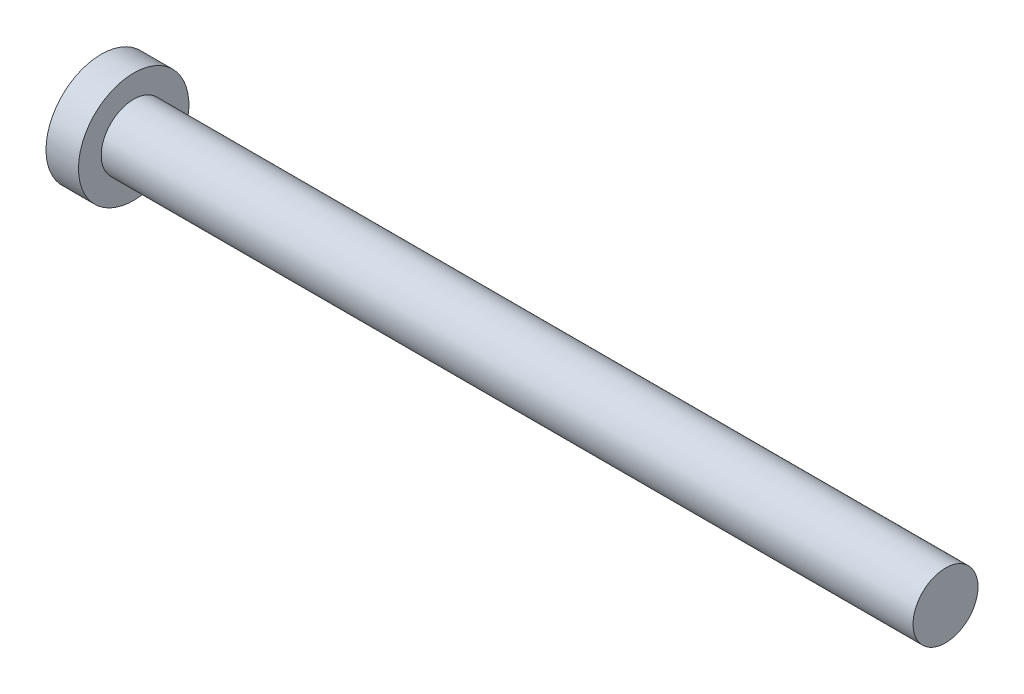
ISO-10303-21;
HEADER;
FILE_DESCRIPTION(('STEP AP214'),'2;1');
FILE_NAME('part.step','',(''),(''),'','','');
FILE_SCHEMA(('AUTOMOTIVE_DESIGN { 1 0 10303 214 1 1 1 1 }'));
ENDSEC;
DATA;
#1=APPLICATION_CONTEXT('core data for automotive mechanical design processes');
#2=APPLICATION_PROTOCOL_DEFINITION('international standard','automotive_design',2000,#1);
#3=PRODUCT_CONTEXT('',#1,'mechanical');
#4=PRODUCT('Part','Part','',(#3));
#5=PRODUCT_RELATED_PRODUCT_CATEGORY('part','',(#4));
#6=PRODUCT_DEFINITION_FORMATION('','',#4);
#7=PRODUCT_DEFINITION_CONTEXT('part definition',#1,'design');
#8=PRODUCT_DEFINITION('design','',#6,#7);
#9=PRODUCT_DEFINITION_SHAPE('','',#8);
#10=(LENGTH_UNIT() NAMED_UNIT(*) SI_UNIT(.MILLI.,.METRE.));
#11=(NAMED_UNIT(*) PLANE_ANGLE_UNIT() SI_UNIT($,.RADIAN.));
#12=(NAMED_UNIT(*) SI_UNIT($,.STERADIAN.) SOLID_ANGLE_UNIT());
#13=UNCERTAINTY_MEASURE_WITH_UNIT(LENGTH_MEASURE(1.E-05),#10,'distance_accuracy_value','');
#14=(GEOMETRIC_REPRESENTATION_CONTEXT(3) GLOBAL_UNCERTAINTY_ASSIGNED_CONTEXT((#13)) GLOBAL_UNIT_ASSIGNED_CONTEXT((#10,
#11,#12)) REPRESENTATION_CONTEXT('',''));
#15=CARTESIAN_POINT('',(0.,0.,0.));
#16=DIRECTION('',(0.,0.,1.));
#17=DIRECTION('',(1.,0.,0.));
#18=AXIS2_PLACEMENT_3D('',#15,#16,#17);
#19=CARTESIAN_POINT('',(1.2,-0.19,-0.19));
#20=DIRECTION('',(-1.,0.,0.));
#21=DIRECTION('',(0.,0.,1.));
#22=AXIS2_PLACEMENT_3D('',#19,#20,#21);
#23=PLANE('',#22);
#24=DIRECTION('',(0.,0.,-1.));
#25=VECTOR('',#24,1.);
#26=CARTESIAN_POINT('',(1.2,0.095,0.843966809971212));
#27=LINE('',#26,#25);
#28=CARTESIAN_POINT('',(1.2,0.095,0.095));
#29=VERTEX_POINT('',#28);
#30=CARTESIAN_POINT('',(1.20000000000001,0.0950000000000003,0.190000000000022));
#31=VERTEX_POINT('',#30);
#32=EDGE_CURVE('E171',#29,#31,#27,.F.);
#33=ORIENTED_EDGE('',*,*,#32,.F.);
#34=DIRECTION('',(0.,1.,0.));
#35=VECTOR('',#34,1.);
#36=CARTESIAN_POINT('',(1.2,0.095,0.095));
#37=LINE('',#36,#35);
#38=CARTESIAN_POINT('',(1.2,0.19,0.095));
#39=VERTEX_POINT('',#38);
#40=EDGE_CURVE('E177',#39,#29,#37,.F.);
#41=ORIENTED_EDGE('',*,*,#40,.F.);
#42=DIRECTION('',(0.,0.,1.));
#43=VECTOR('',#42,1.);
#44=CARTESIAN_POINT('',(1.2,0.19,-0.095));
#45=LINE('',#44,#43);
#46=CARTESIAN_POINT('',(1.2,0.19,-0.0950000000000004));
#47=VERTEX_POINT('',#46);
#48=EDGE_CURVE('E201',#47,#39,#45,.T.);
#49=ORIENTED_EDGE('',*,*,#48,.F.);
#50=DIRECTION('',(0.,1.,0.));
#51=VECTOR('',#50,1.);
#52=CARTESIAN_POINT('',(1.2,0.095,-0.095));
#53=LINE('',#52,#51);
#54=CARTESIAN_POINT('',(1.2,0.0950000000000001,-0.095));
#55=VERTEX_POINT('',#54);
#56=EDGE_CURVE('E196',#55,#47,#53,.T.);
#57=ORIENTED_EDGE('',*,*,#56,.F.);
#58=DIRECTION('',(0.,0.,-1.));
#59=VECTOR('',#58,1.);
#60=CARTESIAN_POINT('',(1.2,0.095,-0.095));
#61=LINE('',#60,#59);
#62=CARTESIAN_POINT('',(1.2,0.095,-0.19));
#63=VERTEX_POINT('',#62);
#64=EDGE_CURVE('E211',#63,#55,#61,.F.);
#65=ORIENTED_EDGE('',*,*,#64,.F.);
#66=DIRECTION('',(0.,1.,0.));
#67=VECTOR('',#66,1.);
#68=CARTESIAN_POINT('',(1.2,-0.095,-0.19));
#69=LINE('',#68,#67);
#70=CARTESIAN_POINT('',(1.2,-0.0950000000000003,-0.19));
#71=VERTEX_POINT('',#70);
#72=EDGE_CURVE('E131',#71,#63,#69,.T.);
#73=ORIENTED_EDGE('',*,*,#72,.F.);
#74=DIRECTION('',(0.,0.,1.));
#75=VECTOR('',#74,1.);
#76=CARTESIAN_POINT('',(1.2,-0.095,-0.095));
#77=LINE('',#76,#75);
#78=CARTESIAN_POINT('',(1.20000000000001,-0.095,-0.095));
#79=VERTEX_POINT('',#78);
#80=EDGE_CURVE('E128',#79,#71,#77,.F.);
#81=ORIENTED_EDGE('',*,*,#80,.F.);
#82=DIRECTION('',(0.,1.,0.));
#83=VECTOR('',#82,1.);
#84=CARTESIAN_POINT('',(1.20000000000001,-0.843966809971212,-0.095));
#85=LINE('',#84,#83);
#86=CARTESIAN_POINT('',(1.20000000000002,-0.190000000000025,-0.095));
#87=VERTEX_POINT('',#86);
#88=EDGE_CURVE('E195',#87,#79,#85,.T.);
#89=ORIENTED_EDGE('',*,*,#88,.F.);
#90=DIRECTION('',(0.,0.,1.));
#91=VECTOR('',#90,1.);
#92=CARTESIAN_POINT('',(1.20000000000002,-0.190000000000025,-0.095));
#93=LINE('',#92,#91);
#94=CARTESIAN_POINT('',(1.20000000000001,-0.190000000000022,0.0950000000000004));
#95=VERTEX_POINT('',#94);
#96=EDGE_CURVE('E184',#95,#87,#93,.F.);
#97=ORIENTED_EDGE('',*,*,#96,.F.);
#98=DIRECTION('',(0.,1.,0.));
#99=VECTOR('',#98,1.);
#100=CARTESIAN_POINT('',(1.2,-0.843966809971212,0.095));
#101=LINE('',#100,#99);
#102=CARTESIAN_POINT('',(1.2,-0.0950000000000001,0.095));
#103=VERTEX_POINT('',#102);
#104=EDGE_CURVE('E190',#103,#95,#101,.F.);
#105=ORIENTED_EDGE('',*,*,#104,.F.);
#106=DIRECTION('',(0.,0.,1.));
#107=VECTOR('',#106,1.);
#108=CARTESIAN_POINT('',(1.20000000000001,-0.095,0.843966809971212));
#109=LINE('',#108,#107);
#110=CARTESIAN_POINT('',(1.20000000000002,-0.095,0.190000000000025));
#111=VERTEX_POINT('',#110);
#112=EDGE_CURVE('E219',#111,#103,#109,.F.);
#113=ORIENTED_EDGE('',*,*,#112,.F.);
#114=DIRECTION('',(0.,1.,0.));
#115=VECTOR('',#114,1.);
#116=CARTESIAN_POINT('',(1.20000000000002,-0.095,0.190000000000025));
#117=LINE('',#116,#115);
#118=EDGE_CURVE('E147',#31,#111,#117,.F.);
#119=ORIENTED_EDGE('',*,*,#118,.F.);
#120=EDGE_LOOP('',(#33,#41,#49,#57,#65,#73,#81,#89,#97,#105,#113,#119));
#121=FACE_BOUND('',#120,.T.);
#122=ADVANCED_FACE('F17',(#121),#23,.T.);
#123=CARTESIAN_POINT('',(0.02019022267104,-0.095,-0.095));
#124=DIRECTION('',(0.,1.,0.));
#125=DIRECTION('',(0.,0.,1.));
#126=AXIS2_PLACEMENT_3D('',#123,#124,#125);
#127=PLANE('',#126);
#128=DIRECTION('',(0.844819075554241,0.,0.535052081184326));
#129=VECTOR('',#128,1.);
#130=CARTESIAN_POINT('',(1.2,-0.0950000000000005,-0.19));
#131=LINE('',#130,#129);
#132=CARTESIAN_POINT('',(0.179129531050745,-0.0950000000000008,-0.836551297001163));
#133=VERTEX_POINT('',#132);
#134=EDGE_CURVE('E125',#133,#71,#131,.T.);
#135=ORIENTED_EDGE('',*,*,#134,.F.);
#136=CARTESIAN_POINT('',(0.0201902226710378,-0.0949999999999999,-0.0950000000000002));
#137=CARTESIAN_POINT('',(0.0226398425543797,-0.095,-0.115973537349649));
#138=CARTESIAN_POINT('',(0.0254310616733796,-0.095,-0.136901889729609));
#139=CARTESIAN_POINT('',(0.031513977938195,-0.095,-0.178683060358681));
#140=CARTESIAN_POINT('',(0.0348055950614788,-0.095,-0.199535890140267));
#141=CARTESIAN_POINT('',(0.0417027666883325,-0.095,-0.241159060685075));
#142=CARTESIAN_POINT('',(0.0453078857145207,-0.095,-0.261929475257049));
#143=CARTESIAN_POINT('',(0.0527977658908118,-0.095,-0.303420906414412));
#144=CARTESIAN_POINT('',(0.0566825410806537,-0.095,-0.32414192046569));
#145=CARTESIAN_POINT('',(0.0687079641287518,-0.095,-0.386210617550224));
#146=CARTESIAN_POINT('',(0.0772234385665859,-0.095,-0.427486049649871));
#147=CARTESIAN_POINT('',(0.0951732951897512,-0.095,-0.509828657388712));
#148=CARTESIAN_POINT('',(0.104607525851427,-0.095,-0.55089586619724));
#149=CARTESIAN_POINT('',(0.124372929898086,-0.095,-0.632841771316391));
#150=CARTESIAN_POINT('',(0.134704675408607,-0.095,-0.673720329627371));
#151=CARTESIAN_POINT('',(0.156256369772992,-0.095,-0.755291264272398));
#152=CARTESIAN_POINT('',(0.167477292619544,-0.095,-0.795983383316545));
#153=CARTESIAN_POINT('',(0.179129531050741,-0.095,-0.836551297001183));
#154=B_SPLINE_CURVE_WITH_KNOTS('',3,(#136,#137,#138,#139,#140,#141,#142,#143,#144,#145,#146,
#147,#148,#149,#150,#151,#152,#153),.UNSPECIFIED.,.F.,.F.,(4,2,2,2,2,2,2,2,4),(0.,
0.063338021498771,0.126665924756856,0.189907224655068,0.253151701709765,0.379573454882021,
0.505974393447311,0.632456506666061,0.759079134417615),.UNSPECIFIED.);
#155=CARTESIAN_POINT('',(0.0201902226710386,-0.095,-0.0950000000000001));
#156=VERTEX_POINT('',#155);
#157=EDGE_CURVE('E21',#156,#133,#154,.T.);
#158=ORIENTED_EDGE('',*,*,#157,.F.);
#159=DIRECTION('',(1.,0.,0.));
#160=VECTOR('',#159,1.);
#161=CARTESIAN_POINT('',(0.02019022267104,-0.095,-0.095));
#162=LINE('',#161,#160);
#163=EDGE_CURVE('E193',#79,#156,#162,.F.);
#164=ORIENTED_EDGE('',*,*,#163,.F.);
#165=ORIENTED_EDGE('',*,*,#80,.T.);
#166=EDGE_LOOP('',(#135,#158,#164,#165));
#167=FACE_BOUND('',#166,.T.);
#168=ADVANCED_FACE('F127',(#167),#127,.T.);
#169=CARTESIAN_POINT('',(1.2,-0.095,-0.19));
#170=DIRECTION('',(-0.535052081184326,0.,0.844819075554241));
#171=DIRECTION('',(0.844819075554241,0.,0.535052081184326));
#172=AXIS2_PLACEMENT_3D('',#169,#170,#171);
#173=PLANE('',#172);
#174=CARTESIAN_POINT('',(0.179129531050737,-0.0950000000000011,-0.836551297001168));
#175=CARTESIAN_POINT('',(0.178254696167839,-0.0633333333333341,-0.83710535909367));
#176=CARTESIAN_POINT('',(0.177817278726389,-0.031666666666667,-0.837382390139921));
#177=CARTESIAN_POINT('',(0.177817278726389,0.031666666666667,-0.837382390139921));
#178=CARTESIAN_POINT('',(0.178254696167839,0.0633333333333341,-0.83710535909367));
#179=CARTESIAN_POINT('',(0.179129531050737,0.0950000000000011,-0.836551297001168));
#180=B_SPLINE_CURVE_WITH_KNOTS('',3,(#174,#175,#176,#177,#178,#179),.UNSPECIFIED.,.F.,.F.,(4,2,
4),(0.,0.0950126976880893,0.190025395376179),.UNSPECIFIED.);
#181=CARTESIAN_POINT('',(0.179129531050757,0.095,-0.836551297001189));
#182=VERTEX_POINT('',#181);
#183=EDGE_CURVE('E134',#133,#182,#180,.T.);
#184=ORIENTED_EDGE('',*,*,#183,.F.);
#185=ORIENTED_EDGE('',*,*,#134,.T.);
#186=ORIENTED_EDGE('',*,*,#72,.T.);
#187=DIRECTION('',(0.844819075554225,0.,0.535052081184351));
#188=VECTOR('',#187,1.);
#189=CARTESIAN_POINT('',(0.179129531050772,0.095,-0.836551297001188));
#190=LINE('',#189,#188);
#191=EDGE_CURVE('E130',#182,#63,#190,.T.);
#192=ORIENTED_EDGE('',*,*,#191,.F.);
#193=EDGE_LOOP('',(#184,#185,#186,#192));
#194=FACE_BOUND('',#193,.T.);
#195=ADVANCED_FACE('F135',(#194),#173,.T.);
#196=CARTESIAN_POINT('',(0.02019022267104,0.095,-0.095));
#197=DIRECTION('',(0.,-1.,0.));
#198=DIRECTION('',(0.,0.,-1.));
#199=AXIS2_PLACEMENT_3D('',#196,#197,#198);
#200=PLANE('',#199);
#201=ORIENTED_EDGE('',*,*,#64,.T.);
#202=DIRECTION('',(1.,0.,0.));
#203=VECTOR('',#202,1.);
#204=CARTESIAN_POINT('',(0.02019022267104,0.0950000000000001,-0.095));
#205=LINE('',#204,#203);
#206=CARTESIAN_POINT('',(0.0201902226710386,0.0950000000000002,-0.095));
#207=VERTEX_POINT('',#206);
#208=EDGE_CURVE('E208',#207,#55,#205,.T.);
#209=ORIENTED_EDGE('',*,*,#208,.F.);
#210=CARTESIAN_POINT('',(0.179129531050743,0.0950000000000001,-0.836551297001189));
#211=CARTESIAN_POINT('',(0.167477292619542,0.0950000000000002,-0.795983383316541));
#212=CARTESIAN_POINT('',(0.156256369772988,0.0950000000000001,-0.755291264272383));
#213=CARTESIAN_POINT('',(0.134704675408598,0.0949999999999999,-0.673720329627334));
#214=CARTESIAN_POINT('',(0.124372929898074,0.0949999999999998,-0.632841771316343));
#215=CARTESIAN_POINT('',(0.10460752585141,0.0950000000000002,-0.55089586619717));
#216=CARTESIAN_POINT('',(0.0951732951897327,0.0950000000000006,-0.50982865738863));
#217=CARTESIAN_POINT('',(0.0772234385665639,0.0949999999999994,-0.427486049649767));
#218=CARTESIAN_POINT('',(0.0687079641287281,0.0949999999999977,-0.386210617550109));
#219=CARTESIAN_POINT('',(0.0566825410806288,0.0950000000000012,-0.324141920465558));
#220=CARTESIAN_POINT('',(0.0527977658907866,0.0950000000000034,-0.303420906414275));
#221=CARTESIAN_POINT('',(0.0453078857144941,0.0949999999999966,-0.261929475256901));
#222=CARTESIAN_POINT('',(0.0417027666883046,0.0949999999999877,-0.24115906068492));
#223=CARTESIAN_POINT('',(0.0348055950614536,0.0950000000000123,-0.199535890140101));
#224=CARTESIAN_POINT('',(0.0315139779381737,0.0950000000000458,-0.178683060358509));
#225=CARTESIAN_POINT('',(0.0254310616733492,0.0949999999999542,-0.136901889729428));
#226=CARTESIAN_POINT('',(0.0226398425543363,0.0949999999998289,-0.115973537349464));
#227=CARTESIAN_POINT('',(0.020190222670962,0.0949999999995235,-0.0949999999998141));
#228=B_SPLINE_CURVE_WITH_KNOTS('',3,(#210,#211,#212,#213,#214,#215,#216,#217,#218,#219,#220,
#221,#222,#223,#224,#225,#226,#227),.UNSPECIFIED.,.F.,.F.,(4,2,2,2,2,2,2,2,4),(0.,
0.126622627751588,0.253104740970372,0.379505679535696,0.505927432707986,0.5691719097627,
0.632413209660928,0.69574111291903,0.759079134417816),.UNSPECIFIED.);
#229=EDGE_CURVE('E139',#182,#207,#228,.T.);
#230=ORIENTED_EDGE('',*,*,#229,.F.);
#231=ORIENTED_EDGE('',*,*,#191,.T.);
#232=EDGE_LOOP('',(#201,#209,#230,#231));
#233=FACE_BOUND('',#232,.T.);
#234=ADVANCED_FACE('F368',(#233),#200,.T.);
#235=CARTESIAN_POINT('',(0.02019022267104,0.095,-0.095));
#236=DIRECTION('',(0.,0.,1.));
#237=DIRECTION('',(1.,0.,0.));
#238=AXIS2_PLACEMENT_3D('',#235,#236,#237);
#239=PLANE('',#238);
#240=DIRECTION('',(0.844819075554241,-0.535052081184326,0.));
#241=VECTOR('',#240,1.);
#242=CARTESIAN_POINT('',(1.2,0.19,-0.0950000000000006));
#243=LINE('',#242,#241);
#244=CARTESIAN_POINT('',(0.179129531050743,0.836551297001164,-0.0950000000000009));
#245=VERTEX_POINT('',#244);
#246=EDGE_CURVE('E178',#245,#47,#243,.T.);
#247=ORIENTED_EDGE('',*,*,#246,.F.);
#248=CARTESIAN_POINT('',(0.0201902226710378,0.0950000000000003,-0.095));
#249=CARTESIAN_POINT('',(0.0226398425543811,0.115973537349649,-0.095));
#250=CARTESIAN_POINT('',(0.0254310616733818,0.136901889729609,-0.095));
#251=CARTESIAN_POINT('',(0.0315139779381978,0.17868306035868,-0.095));
#252=CARTESIAN_POINT('',(0.0348055950614816,0.199535890140267,-0.095));
#253=CARTESIAN_POINT('',(0.041702766688335,0.241159060685075,-0.095));
#254=CARTESIAN_POINT('',(0.0453078857145231,0.261929475257049,-0.095));
#255=CARTESIAN_POINT('',(0.0527977658908136,0.303420906414412,-0.095));
#256=CARTESIAN_POINT('',(0.0566825410806552,0.324141920465691,-0.095));
#257=CARTESIAN_POINT('',(0.0687079641287525,0.386210617550225,-0.095));
#258=CARTESIAN_POINT('',(0.0772234385665861,0.427486049649872,-0.095));
#259=CARTESIAN_POINT('',(0.0951732951897505,0.509828657388713,-0.095));
#260=CARTESIAN_POINT('',(0.104607525851426,0.550895866197241,-0.095));
#261=CARTESIAN_POINT('',(0.124372929898084,0.632841771316393,-0.095));
#262=CARTESIAN_POINT('',(0.134704675408605,0.673720329627373,-0.095));
#263=CARTESIAN_POINT('',(0.15625636977299,0.755291264272401,-0.095));
#264=CARTESIAN_POINT('',(0.167477292619541,0.795983383316548,-0.095));
#265=CARTESIAN_POINT('',(0.179129531050737,0.836551297001186,-0.095));
#266=B_SPLINE_CURVE_WITH_KNOTS('',3,(#248,#249,#250,#251,#252,#253,#254,#255,#256,#257,#258,
#259,#260,#261,#262,#263,#264,#265),.UNSPECIFIED.,.F.,.F.,(4,2,2,2,2,2,2,2,4),(0.,
0.063338021498771,0.126665924756856,0.189907224655068,0.253151701709765,0.379573454882021,
0.505974393447312,0.632456506666063,0.759079134417617),.UNSPECIFIED.);
#267=EDGE_CURVE('E353',#207,#245,#266,.T.);
#268=ORIENTED_EDGE('',*,*,#267,.F.);
#269=ORIENTED_EDGE('',*,*,#208,.T.);
#270=ORIENTED_EDGE('',*,*,#56,.T.);
#271=EDGE_LOOP('',(#247,#268,#269,#270));
#272=FACE_BOUND('',#271,.T.);
#273=ADVANCED_FACE('F364',(#272),#239,.T.);
#274=CARTESIAN_POINT('',(0.02019022267104,-0.843966809971212,-0.095));
#275=DIRECTION('',(0.,0.,1.));
#276=DIRECTION('',(1.,0.,0.));
#277=AXIS2_PLACEMENT_3D('',#274,#275,#276);
#278=PLANE('',#277);
#279=DIRECTION('',(-0.844819075554241,-0.535052081184326,0.));
#280=VECTOR('',#279,1.);
#281=CARTESIAN_POINT('',(0.167595451513688,-0.843856214041336,-0.095));
#282=LINE('',#281,#280);
#283=CARTESIAN_POINT('',(0.179129531050756,-0.836551297001194,-0.095));
#284=VERTEX_POINT('',#283);
#285=EDGE_CURVE('E199',#87,#284,#282,.T.);
#286=ORIENTED_EDGE('',*,*,#285,.F.);
#287=ORIENTED_EDGE('',*,*,#88,.T.);
#288=ORIENTED_EDGE('',*,*,#163,.T.);
#289=CARTESIAN_POINT('',(0.179129531050743,-0.836551297001203,-0.095));
#290=CARTESIAN_POINT('',(0.167477292619545,-0.795983383316564,-0.095));
#291=CARTESIAN_POINT('',(0.156256369772994,-0.755291264272416,-0.095));
#292=CARTESIAN_POINT('',(0.134704675408609,-0.673720329627386,-0.095));
#293=CARTESIAN_POINT('',(0.124372929898087,-0.632841771316406,-0.095));
#294=CARTESIAN_POINT('',(0.104607525851428,-0.550895866197252,-0.095));
#295=CARTESIAN_POINT('',(0.0951732951897528,-0.509828657388723,-0.095));
#296=CARTESIAN_POINT('',(0.0772234385665878,-0.42748604964988,-0.095));
#297=CARTESIAN_POINT('',(0.0687079641287539,-0.386210617550232,-0.095));
#298=CARTESIAN_POINT('',(0.0566825410806563,-0.324141920465696,-0.095));
#299=CARTESIAN_POINT('',(0.0527977658908146,-0.303420906414417,-0.095));
#300=CARTESIAN_POINT('',(0.0453078857145238,-0.261929475257053,-0.095));
#301=CARTESIAN_POINT('',(0.0417027666883357,-0.241159060685078,-0.095));
#302=CARTESIAN_POINT('',(0.0348055950614821,-0.19953589014027,-0.095));
#303=CARTESIAN_POINT('',(0.0315139779381982,-0.178683060358682,-0.095));
#304=CARTESIAN_POINT('',(0.0254310616733819,-0.13690188972961,-0.095));
#305=CARTESIAN_POINT('',(0.0226398425543812,-0.115973537349649,-0.095));
#306=CARTESIAN_POINT('',(0.0201902226710378,-0.0950000000000003,-0.0950000000000001));
#307=B_SPLINE_CURVE_WITH_KNOTS('',3,(#289,#290,#291,#292,#293,#294,#295,#296,#297,#298,#299,
#300,#301,#302,#303,#304,#305,#306),.UNSPECIFIED.,.F.,.F.,(4,2,2,2,2,2,2,2,4),(0.,
0.126622627751557,0.253104740970311,0.379505679535605,0.505927432707864,0.569171909762563,
0.632413209660776,0.695741112918863,0.759079134417635),.UNSPECIFIED.);
#308=EDGE_CURVE('E144',#284,#156,#307,.T.);
#309=ORIENTED_EDGE('',*,*,#308,.F.);
#310=EDGE_LOOP('',(#286,#287,#288,#309));
#311=FACE_BOUND('',#310,.T.);
#312=ADVANCED_FACE('F367',(#311),#278,.T.);
#313=CARTESIAN_POINT('',(0.02019022267104,-0.095,0.843966809971212));
#314=DIRECTION('',(0.,1.,0.));
#315=DIRECTION('',(0.,0.,1.));
#316=AXIS2_PLACEMENT_3D('',#313,#314,#315);
#317=PLANE('',#316);
#318=DIRECTION('',(-0.844819075554241,0.,0.535052081184326));
#319=VECTOR('',#318,1.);
#320=CARTESIAN_POINT('',(0.167595451519902,-0.095,0.843856214037401));
#321=LINE('',#320,#319);
#322=CARTESIAN_POINT('',(0.179129531050758,-0.0950000000000004,0.836551297001192));
#323=VERTEX_POINT('',#322);
#324=EDGE_CURVE('E145',#111,#323,#321,.T.);
#325=ORIENTED_EDGE('',*,*,#324,.F.);
#326=ORIENTED_EDGE('',*,*,#112,.T.);
#327=DIRECTION('',(-1.,0.,0.));
#328=VECTOR('',#327,1.);
#329=CARTESIAN_POINT('',(0.02019022267104,-0.0950000000000001,0.095));
#330=LINE('',#329,#328);
#331=CARTESIAN_POINT('',(0.0201902226710386,-0.0950000000000002,0.095));
#332=VERTEX_POINT('',#331);
#333=EDGE_CURVE('E185',#332,#103,#330,.F.);
#334=ORIENTED_EDGE('',*,*,#333,.F.);
#335=CARTESIAN_POINT('',(0.179129531050746,-0.0950000000000001,0.8365512970012));
#336=CARTESIAN_POINT('',(0.167477292619545,-0.0950000000000002,0.795983383316551));
#337=CARTESIAN_POINT('',(0.156256369772991,-0.0950000000000001,0.755291264272393));
#338=CARTESIAN_POINT('',(0.1347046754086,-0.0949999999999999,0.673720329627342));
#339=CARTESIAN_POINT('',(0.124372929898076,-0.0949999999999998,0.632841771316351));
#340=CARTESIAN_POINT('',(0.104607525851412,-0.0950000000000002,0.550895866197176));
#341=CARTESIAN_POINT('',(0.0951732951897342,-0.0950000000000006,0.509828657388636));
#342=CARTESIAN_POINT('',(0.0772234385665649,-0.0949999999999994,0.427486049649772));
#343=CARTESIAN_POINT('',(0.068707964128729,-0.0949999999999977,0.386210617550114));
#344=CARTESIAN_POINT('',(0.0566825410806295,-0.0950000000000012,0.324141920465562));
#345=CARTESIAN_POINT('',(0.0527977658907872,-0.0950000000000034,0.303420906414278));
#346=CARTESIAN_POINT('',(0.0453078857144946,-0.0949999999999966,0.261929475256903));
#347=CARTESIAN_POINT('',(0.041702766688305,-0.0949999999999877,0.241159060684923));
#348=CARTESIAN_POINT('',(0.0348055950614539,-0.0950000000000123,0.199535890140103));
#349=CARTESIAN_POINT('',(0.0315139779381739,-0.0950000000000459,0.17868306035851));
#350=CARTESIAN_POINT('',(0.0254310616733493,-0.0949999999999541,0.136901889729428));
#351=CARTESIAN_POINT('',(0.0226398425543364,-0.0949999999998288,0.115973537349464));
#352=CARTESIAN_POINT('',(0.0201902226709619,-0.0949999999995234,0.094999999999814));
#353=B_SPLINE_CURVE_WITH_KNOTS('',3,(#335,#336,#337,#338,#339,#340,#341,#342,#343,#344,#345,
#346,#347,#348,#349,#350,#351,#352),.UNSPECIFIED.,.F.,.F.,(4,2,2,2,2,2,2,2,4),(0.,
0.12662262775159,0.253104740970376,0.379505679535702,0.505927432707994,0.569171909762708,
0.632413209660938,0.69574111291904,0.759079134417828),.UNSPECIFIED.);
#354=EDGE_CURVE('E566',#323,#332,#353,.T.);
#355=ORIENTED_EDGE('',*,*,#354,.F.);
#356=EDGE_LOOP('',(#325,#326,#334,#355));
#357=FACE_BOUND('',#356,.T.);
#358=ADVANCED_FACE('F479',(#357),#317,.T.);
#359=CARTESIAN_POINT('',(0.02019022267104,-0.843966809971212,0.095));
#360=DIRECTION('',(0.,0.,-1.));
#361=DIRECTION('',(-1.,0.,0.));
#362=AXIS2_PLACEMENT_3D('',#359,#360,#361);
#363=PLANE('',#362);
#364=CARTESIAN_POINT('',(0.0201902226710378,-0.0950000000000003,0.0950000000000001));
#365=CARTESIAN_POINT('',(0.0226398425543812,-0.115973537349649,0.095));
#366=CARTESIAN_POINT('',(0.025431061673382,-0.13690188972961,0.095));
#367=CARTESIAN_POINT('',(0.0315139779381982,-0.178683060358682,0.095));
#368=CARTESIAN_POINT('',(0.0348055950614821,-0.19953589014027,0.095));
#369=CARTESIAN_POINT('',(0.0417027666883357,-0.241159060685078,0.095));
#370=CARTESIAN_POINT('',(0.0453078857145239,-0.261929475257053,0.095));
#371=CARTESIAN_POINT('',(0.0527977658908147,-0.303420906414417,0.095));
#372=CARTESIAN_POINT('',(0.0566825410806564,-0.324141920465696,0.095));
#373=CARTESIAN_POINT('',(0.0687079641287541,-0.386210617550232,0.095));
#374=CARTESIAN_POINT('',(0.0772234385665879,-0.42748604964988,0.095));
#375=CARTESIAN_POINT('',(0.095173295189753,-0.509828657388723,0.095));
#376=CARTESIAN_POINT('',(0.104607525851429,-0.550895866197252,0.095));
#377=CARTESIAN_POINT('',(0.124372929898088,-0.632841771316406,0.095));
#378=CARTESIAN_POINT('',(0.134704675408609,-0.673720329627387,0.095));
#379=CARTESIAN_POINT('',(0.156256369772994,-0.755291264272416,0.095));
#380=CARTESIAN_POINT('',(0.167477292619546,-0.795983383316564,0.095));
#381=CARTESIAN_POINT('',(0.179129531050743,-0.836551297001203,0.095));
#382=B_SPLINE_CURVE_WITH_KNOTS('',3,(#364,#365,#366,#367,#368,#369,#370,#371,#372,#373,#374,
#375,#376,#377,#378,#379,#380,#381),.UNSPECIFIED.,.F.,.F.,(4,2,2,2,2,2,2,2,4),(0.,
0.0633380214987725,0.126665924756859,0.189907224655072,0.253151701709771,0.379573454882031,
0.505974393447324,0.632456506666078,0.759079134417635),.UNSPECIFIED.);
#383=CARTESIAN_POINT('',(0.179129531050756,-0.836551297001193,0.095000000000001));
#384=VERTEX_POINT('',#383);
#385=EDGE_CURVE('E323',#332,#384,#382,.T.);
#386=ORIENTED_EDGE('',*,*,#385,.F.);
#387=ORIENTED_EDGE('',*,*,#333,.T.);
#388=ORIENTED_EDGE('',*,*,#104,.T.);
#389=DIRECTION('',(-0.844819075554241,-0.535052081184326,0.));
#390=VECTOR('',#389,1.);
#391=CARTESIAN_POINT('',(0.167595451513688,-0.843856214041336,0.0950000000000006));
#392=LINE('',#391,#390);
#393=EDGE_CURVE('E181',#384,#95,#392,.F.);
#394=ORIENTED_EDGE('',*,*,#393,.F.);
#395=EDGE_LOOP('',(#386,#387,#388,#394));
#396=FACE_BOUND('',#395,.T.);
#397=ADVANCED_FACE('F332',(#396),#363,.T.);
#398=CARTESIAN_POINT('',(0.167595451513688,-0.843856214041336,-0.095));
#399=DIRECTION('',(-0.535052081184326,0.844819075554241,0.));
#400=DIRECTION('',(-0.844819075554241,-0.535052081184326,0.));
#401=AXIS2_PLACEMENT_3D('',#398,#399,#400);
#402=PLANE('',#401);
#403=ORIENTED_EDGE('',*,*,#96,.T.);
#404=ORIENTED_EDGE('',*,*,#285,.T.);
#405=CARTESIAN_POINT('',(0.177817278726398,-0.837382390139953,0.));
#406=CARTESIAN_POINT('',(0.177817494529176,-0.837382253464861,-0.0158375620022803));
#407=CARTESIAN_POINT('',(0.177926956790926,-0.837312927365752,-0.031673009670092));
#408=CARTESIAN_POINT('',(0.178364374232375,-0.837035896319502,-0.0633396763367619));
#409=CARTESIAN_POINT('',(0.178692329412072,-0.83682819137236,-0.0791708953356201));
#410=CARTESIAN_POINT('',(0.179129531050742,-0.836551297001202,-0.0950000000000016));
#411=B_SPLINE_CURVE_WITH_KNOTS('',3,(#405,#406,#407,#408,#409,#410),.UNSPECIFIED.,.F.,.F.,(4,2,
4),(0.,0.0475079332155473,0.0950158664310947),.UNSPECIFIED.);
#412=CARTESIAN_POINT('',(0.177817278726393,-0.837382390139936,0.));
#413=VERTEX_POINT('',#412);
#414=EDGE_CURVE('E338',#413,#284,#411,.T.);
#415=ORIENTED_EDGE('',*,*,#414,.F.);
#416=CARTESIAN_POINT('',(0.179129531050743,-0.836551297001202,0.0950000000000015));
#417=CARTESIAN_POINT('',(0.178692329412072,-0.83682819137236,0.0791708953356227));
#418=CARTESIAN_POINT('',(0.178364374232375,-0.837035896319502,0.0633396763367672));
#419=CARTESIAN_POINT('',(0.177926956790926,-0.837312927365752,0.0316730096701027));
#420=CARTESIAN_POINT('',(0.177817494529176,-0.837382253464861,0.0158375620022938));
#421=CARTESIAN_POINT('',(0.177817278726398,-0.837382390139953,0.));
#422=B_SPLINE_CURVE_WITH_KNOTS('',3,(#416,#417,#418,#419,#420,#421),.UNSPECIFIED.,.F.,.F.,(4,2,
4),(0.,0.0475079332155392,0.0950158664310784),.UNSPECIFIED.);
#423=EDGE_CURVE('E316',#384,#413,#422,.T.);
#424=ORIENTED_EDGE('',*,*,#423,.F.);
#425=ORIENTED_EDGE('',*,*,#393,.T.);
#426=EDGE_LOOP('',(#403,#404,#415,#424,#425));
#427=FACE_BOUND('',#426,.T.);
#428=ADVANCED_FACE('F329',(#427),#402,.T.);
#429=CARTESIAN_POINT('',(1.2,0.19,-0.095));
#430=DIRECTION('',(-0.535052081184326,-0.844819075554241,0.));
#431=DIRECTION('',(0.844819075554241,-0.535052081184326,0.));
#432=AXIS2_PLACEMENT_3D('',#429,#430,#431);
#433=PLANE('',#432);
#434=CARTESIAN_POINT('',(0.179129531050733,0.83655129700117,-0.0950000000000012));
#435=CARTESIAN_POINT('',(0.178692329412063,0.836828191372328,-0.0791708953356211));
#436=CARTESIAN_POINT('',(0.178364374232365,0.83703589631947,-0.0633396763367643));
#437=CARTESIAN_POINT('',(0.177926956790917,0.83731292736572,-0.0316730096700972));
#438=CARTESIAN_POINT('',(0.177817494529166,0.837382253464829,-0.015837562002287));
#439=CARTESIAN_POINT('',(0.177817278726389,0.837382390139921,0.));
#440=B_SPLINE_CURVE_WITH_KNOTS('',3,(#434,#435,#436,#437,#438,#439),.UNSPECIFIED.,.F.,.F.,(4,2,
4),(0.,0.0475079332155431,0.0950158664310862),.UNSPECIFIED.);
#441=CARTESIAN_POINT('',(0.177817278726389,0.837382390139921,0.));
#442=VERTEX_POINT('',#441);
#443=EDGE_CURVE('E344',#245,#442,#440,.T.);
#444=ORIENTED_EDGE('',*,*,#443,.F.);
#445=ORIENTED_EDGE('',*,*,#246,.T.);
#446=ORIENTED_EDGE('',*,*,#48,.T.);
#447=DIRECTION('',(0.844819075554225,-0.53505208118435,0.));
#448=VECTOR('',#447,1.);
#449=CARTESIAN_POINT('',(0.179129531050771,0.836551297001188,0.095));
#450=LINE('',#449,#448);
#451=CARTESIAN_POINT('',(0.179129531050755,0.83655129700119,0.0949999999999999));
#452=VERTEX_POINT('',#451);
#453=EDGE_CURVE('E174',#452,#39,#450,.T.);
#454=ORIENTED_EDGE('',*,*,#453,.F.);
#455=CARTESIAN_POINT('',(0.177817278726389,0.837382390139921,0.));
#456=CARTESIAN_POINT('',(0.177817494529166,0.837382253464829,0.015837562002287));
#457=CARTESIAN_POINT('',(0.177926956790917,0.83731292736572,0.0316730096700972));
#458=CARTESIAN_POINT('',(0.178364374232365,0.83703589631947,0.0633396763367643));
#459=CARTESIAN_POINT('',(0.178692329412063,0.836828191372328,0.0791708953356211));
#460=CARTESIAN_POINT('',(0.179129531050733,0.83655129700117,0.0950000000000012));
#461=B_SPLINE_CURVE_WITH_KNOTS('',3,(#455,#456,#457,#458,#459,#460),.UNSPECIFIED.,.F.,.F.,(4,2,
4),(0.,0.0475079332155431,0.0950158664310862),.UNSPECIFIED.);
#462=EDGE_CURVE('E309',#442,#452,#461,.T.);
#463=ORIENTED_EDGE('',*,*,#462,.F.);
#464=EDGE_LOOP('',(#444,#445,#446,#454,#463));
#465=FACE_BOUND('',#464,.T.);
#466=ADVANCED_FACE('F299',(#465),#433,.T.);
#467=CARTESIAN_POINT('',(0.02019022267104,0.095,0.095));
#468=DIRECTION('',(0.,0.,-1.));
#469=DIRECTION('',(-1.,0.,0.));
#470=AXIS2_PLACEMENT_3D('',#467,#468,#469);
#471=PLANE('',#470);
#472=ORIENTED_EDGE('',*,*,#40,.T.);
#473=DIRECTION('',(1.,0.,0.));
#474=VECTOR('',#473,1.);
#475=CARTESIAN_POINT('',(0.02019022267104,0.095,0.095));
#476=LINE('',#475,#474);
#477=CARTESIAN_POINT('',(0.0201902226710386,0.095,0.0950000000000001));
#478=VERTEX_POINT('',#477);
#479=EDGE_CURVE('E166',#478,#29,#476,.T.);
#480=ORIENTED_EDGE('',*,*,#479,.F.);
#481=CARTESIAN_POINT('',(0.179129531050739,0.836551297001192,0.0949999999999998));
#482=CARTESIAN_POINT('',(0.167477292619542,0.795983383316553,0.0949999999999999));
#483=CARTESIAN_POINT('',(0.156256369772991,0.755291264272406,0.095));
#484=CARTESIAN_POINT('',(0.134704675408607,0.673720329627378,0.095));
#485=CARTESIAN_POINT('',(0.124372929898085,0.632841771316397,0.095));
#486=CARTESIAN_POINT('',(0.104607525851427,0.550895866197245,0.095));
#487=CARTESIAN_POINT('',(0.0951732951897513,0.509828657388716,0.095));
#488=CARTESIAN_POINT('',(0.0772234385665867,0.427486049649874,0.095));
#489=CARTESIAN_POINT('',(0.068707964128753,0.386210617550228,0.095));
#490=CARTESIAN_POINT('',(0.0566825410806556,0.324141920465692,0.095));
#491=CARTESIAN_POINT('',(0.0527977658908139,0.303420906414414,0.095));
#492=CARTESIAN_POINT('',(0.0453078857145233,0.261929475257051,0.095));
#493=CARTESIAN_POINT('',(0.0417027666883352,0.241159060685076,0.095));
#494=CARTESIAN_POINT('',(0.0348055950614818,0.199535890140268,0.095));
#495=CARTESIAN_POINT('',(0.0315139779381979,0.178683060358681,0.095));
#496=CARTESIAN_POINT('',(0.0254310616733818,0.136901889729609,0.095));
#497=CARTESIAN_POINT('',(0.0226398425543811,0.115973537349649,0.095));
#498=CARTESIAN_POINT('',(0.0201902226710378,0.0950000000000002,0.095));
#499=B_SPLINE_CURVE_WITH_KNOTS('',3,(#481,#482,#483,#484,#485,#486,#487,#488,#489,#490,#491,
#492,#493,#494,#495,#496,#497,#498),.UNSPECIFIED.,.F.,.F.,(4,2,2,2,2,2,2,2,4),(0.,
0.126622627751555,0.253104740970307,0.379505679535599,0.505927432707856,0.569171909762554,
0.632413209660766,0.695741112918852,0.759079134417623),.UNSPECIFIED.);
#500=EDGE_CURVE('E303',#452,#478,#499,.T.);
#501=ORIENTED_EDGE('',*,*,#500,.F.);
#502=ORIENTED_EDGE('',*,*,#453,.T.);
#503=EDGE_LOOP('',(#472,#480,#501,#502));
#504=FACE_BOUND('',#503,.T.);
#505=ADVANCED_FACE('F294',(#504),#471,.T.);
#506=CARTESIAN_POINT('',(0.02019022267104,0.095,0.843966809971212));
#507=DIRECTION('',(0.,-1.,0.));
#508=DIRECTION('',(0.,0.,-1.));
#509=AXIS2_PLACEMENT_3D('',#506,#507,#508);
#510=PLANE('',#509);
#511=CARTESIAN_POINT('',(0.0201902226710378,0.0950000000000001,0.0950000000000002));
#512=CARTESIAN_POINT('',(0.0226398425543798,0.095,0.115973537349649));
#513=CARTESIAN_POINT('',(0.0254310616733797,0.095,0.13690188972961));
#514=CARTESIAN_POINT('',(0.0315139779381953,0.095,0.178683060358682));
#515=CARTESIAN_POINT('',(0.0348055950614792,0.095,0.19953589014027));
#516=CARTESIAN_POINT('',(0.041702766688333,0.095,0.241159060685078));
#517=CARTESIAN_POINT('',(0.0453078857145214,0.095,0.261929475257053));
#518=CARTESIAN_POINT('',(0.0527977658908126,0.095,0.303420906414417));
#519=CARTESIAN_POINT('',(0.0566825410806547,0.095,0.324141920465696));
#520=CARTESIAN_POINT('',(0.0687079641287531,0.095,0.386210617550231));
#521=CARTESIAN_POINT('',(0.0772234385665874,0.095,0.427486049649878));
#522=CARTESIAN_POINT('',(0.0951732951897533,0.095,0.509828657388721));
#523=CARTESIAN_POINT('',(0.104607525851429,0.095,0.55089586619725));
#524=CARTESIAN_POINT('',(0.124372929898089,0.095,0.632841771316403));
#525=CARTESIAN_POINT('',(0.134704675408611,0.095,0.673720329627384));
#526=CARTESIAN_POINT('',(0.156256369772996,0.095,0.755291264272413));
#527=CARTESIAN_POINT('',(0.167477292619548,0.095,0.795983383316561));
#528=CARTESIAN_POINT('',(0.179129531050746,0.095,0.8365512970012));
#529=B_SPLINE_CURVE_WITH_KNOTS('',3,(#511,#512,#513,#514,#515,#516,#517,#518,#519,#520,#521,
#522,#523,#524,#525,#526,#527,#528),.UNSPECIFIED.,.F.,.F.,(4,2,2,2,2,2,2,2,4),(0.,
0.0633380214987725,0.126665924756859,0.189907224655072,0.25315170170977,0.379573454882029,
0.505974393447323,0.632456506666076,0.759079134417633),.UNSPECIFIED.);
#530=CARTESIAN_POINT('',(0.179129531050758,0.0950000000000009,0.836551297001192));
#531=VERTEX_POINT('',#530);
#532=EDGE_CURVE('E273',#478,#531,#529,.T.);
#533=ORIENTED_EDGE('',*,*,#532,.F.);
#534=ORIENTED_EDGE('',*,*,#479,.T.);
#535=ORIENTED_EDGE('',*,*,#32,.T.);
#536=DIRECTION('',(-0.844819075554241,0.,0.535052081184326));
#537=VECTOR('',#536,1.);
#538=CARTESIAN_POINT('',(0.167595451519902,0.0950000000000005,0.843856214037401));
#539=LINE('',#538,#537);
#540=EDGE_CURVE('E154',#531,#31,#539,.F.);
#541=ORIENTED_EDGE('',*,*,#540,.F.);
#542=EDGE_LOOP('',(#533,#534,#535,#541));
#543=FACE_BOUND('',#542,.T.);
#544=ADVANCED_FACE('F287',(#543),#510,.T.);
#545=CARTESIAN_POINT('',(0.167595451519902,-0.095,0.843856214037401));
#546=DIRECTION('',(-0.535052081184326,0.,-0.844819075554241));
#547=DIRECTION('',(-0.844819075554241,0.,0.535052081184326));
#548=AXIS2_PLACEMENT_3D('',#545,#546,#547);
#549=PLANE('',#548);
#550=ORIENTED_EDGE('',*,*,#118,.T.);
#551=ORIENTED_EDGE('',*,*,#324,.T.);
#552=CARTESIAN_POINT('',(0.179129531050746,0.0950000000000013,0.8365512970012));
#553=CARTESIAN_POINT('',(0.178254696167848,0.0633333333333342,0.837105359093702));
#554=CARTESIAN_POINT('',(0.177817278726399,0.0316666666666671,0.837382390139953));
#555=CARTESIAN_POINT('',(0.177817278726399,-0.0316666666666671,0.837382390139953));
#556=CARTESIAN_POINT('',(0.178254696167848,-0.0633333333333342,0.837105359093702));
#557=CARTESIAN_POINT('',(0.179129531050746,-0.0950000000000013,0.8365512970012));
#558=B_SPLINE_CURVE_WITH_KNOTS('',3,(#552,#553,#554,#555,#556,#557),.UNSPECIFIED.,.F.,.F.,(4,2,
4),(0.,0.0950126976880895,0.190025395376179),.UNSPECIFIED.);
#559=EDGE_CURVE('E266',#531,#323,#558,.T.);
#560=ORIENTED_EDGE('',*,*,#559,.F.);
#561=ORIENTED_EDGE('',*,*,#540,.T.);
#562=EDGE_LOOP('',(#550,#551,#560,#561));
#563=FACE_BOUND('',#562,.T.);
#564=ADVANCED_FACE('F284',(#563),#549,.T.);
#565=CARTESIAN_POINT('',(0.500000000000051,1.69999999999998,1.04465733497541E-13));
#566=CARTESIAN_POINT('',(0.266576454025929,1.19670178786835,0.));
#567=CARTESIAN_POINT('',(0.104750277507679,0.666052729306618,0.));
#568=CARTESIAN_POINT('',(0.0175957998066091,0.118183471958249,0.));
#569=CARTESIAN_POINT('',(0.500000000000048,1.70000000000057,-1.01632491159157));
#570=CARTESIAN_POINT('',(0.266576454025929,1.19670178786843,-0.715434022798148));
#571=CARTESIAN_POINT('',(0.104750277507679,0.666052729306628,-0.398191753663438));
#572=CARTESIAN_POINT('',(0.0175957998066097,0.118183471958247,-0.0706545921703425));
#573=CARTESIAN_POINT('',(0.500000000000048,0.975172879849687,-1.6999999999997));
#574=CARTESIAN_POINT('',(0.266576454025929,0.686465369880197,-1.1967017878685));
#575=CARTESIAN_POINT('',(0.104750277507679,0.382068563629076,-0.666052729306553));
#576=CARTESIAN_POINT('',(0.0175957998066095,0.0677937157059595,-0.118183471958292));
#577=CARTESIAN_POINT('',(0.500000000000052,0.,-1.69999999999971));
#578=CARTESIAN_POINT('',(0.26657645402593,0.,-1.1967017878685));
#579=CARTESIAN_POINT('',(0.104750277507679,0.,-0.66605272930655));
#580=CARTESIAN_POINT('',(0.0175957998066088,0.,-0.118183471958287));
#581=CARTESIAN_POINT('',(0.500000000000048,-0.975172879849695,-1.6999999999997));
#582=CARTESIAN_POINT('',(0.266576454025929,-0.686465369880203,-1.1967017878685));
#583=CARTESIAN_POINT('',(0.104750277507679,-0.382068563629079,-0.666052729306553));
#584=CARTESIAN_POINT('',(0.0175957998066095,-0.0677937157059601,-0.118183471958292));
#585=CARTESIAN_POINT('',(0.500000000000048,-1.70000000000058,-1.01632491159156));
#586=CARTESIAN_POINT('',(0.266576454025929,-1.19670178786843,-0.715434022798142));
#587=CARTESIAN_POINT('',(0.104750277507679,-0.666052729306632,-0.398191753663434));
#588=CARTESIAN_POINT('',(0.0175957998066097,-0.118183471958247,-0.0706545921703419));
#589=CARTESIAN_POINT('',(0.500000000000051,-1.69999999999998,1.20847280103043E-13));
#590=CARTESIAN_POINT('',(0.266576454025929,-1.19670178786835,0.));
#591=CARTESIAN_POINT('',(0.104750277507679,-0.666052729306618,0.));
#592=CARTESIAN_POINT('',(0.0175957998066091,-0.118183471958249,0.));
#593=(BOUNDED_SURFACE() B_SPLINE_SURFACE(3,3,((#565,#566,#567,#568),(#569,#570,#571,#572),(#573,
#574,#575,#576),(#577,#578,#579,#580),(#581,#582,#583,#584),(#585,#586,#587,#588),(#589,#590,
#591,#592)),.UNSPECIFIED.,.F.,.F.,.F.) B_SPLINE_SURFACE_WITH_KNOTS((4,3,4),(4,4),
(0.145073629373376,1.,1.85492637062663),(0.0192921641904096,0.990321992525707),
.UNSPECIFIED.) GEOMETRIC_REPRESENTATION_ITEM() RATIONAL_B_SPLINE_SURFACE(((1.12455185335026,
1.11746869169792,1.11753952331444,1.12476434819983),(0.932089030354127,0.92621812519624,
0.926276834247818,0.932265157508862),(0.971422935302074,0.965304279534572,0.965365466092246,
0.971606494975098),(1.2425535681941,1.23472715471291,1.23480541884772,1.24278836059854),
(0.971422935302072,0.96530427953457,0.965365466092244,0.971606494975096),(0.932089030354126,
0.926218125196239,0.926276834247818,0.932265157508861),(1.12455185335027,1.11746869169792,
1.11753952331444,1.12476434819983))) REPRESENTATION_ITEM('') SURFACE());
#594=CARTESIAN_POINT('',(0.500000000000051,1.69999999999998,-1.0446573349754E-13));
#595=CARTESIAN_POINT('',(0.266576454025929,1.19670178786835,0.));
#596=CARTESIAN_POINT('',(0.104750277507679,0.666052729306618,0.));
#597=CARTESIAN_POINT('',(0.0175957998066091,0.118183471958249,0.));
#598=(BOUNDED_CURVE() B_SPLINE_CURVE(3,(#594,#595,#596,#597),.UNSPECIFIED.,.F.,
.F.) B_SPLINE_CURVE_WITH_KNOTS((4,4),(0.0192921641904097,0.990321992525707),
.UNSPECIFIED.) CURVE() GEOMETRIC_REPRESENTATION_ITEM() RATIONAL_B_SPLINE_CURVE((1.12455185335026,
1.11746869169792,1.11753952331444,1.12476434819983)) REPRESENTATION_ITEM(''));
#599=CARTESIAN_POINT('',(0.500000000000013,1.7,0.));
#600=VERTEX_POINT('',#599);
#601=EDGE_CURVE('E315',#600,#442,#598,.T.);
#602=CARTESIAN_POINT('',(0.5,0.,0.));
#603=DIRECTION('',(1.,0.,0.));
#604=DIRECTION('',(0.,0.,-1.));
#605=AXIS2_PLACEMENT_3D('',#602,#603,#604);
#606=CIRCLE('',#605,1.7);
#607=CARTESIAN_POINT('',(0.500000000000013,-1.7,0.));
#608=VERTEX_POINT('',#607);
#609=EDGE_CURVE('E41',#608,#600,#606,.T.);
#610=CARTESIAN_POINT('',(0.500000000000051,-1.69999999999998,0.));
#611=CARTESIAN_POINT('',(0.266576454025929,-1.19670178786835,0.));
#612=CARTESIAN_POINT('',(0.104750277507679,-0.666052729306618,0.));
#613=CARTESIAN_POINT('',(0.0175957998066091,-0.118183471958249,0.));
#614=(BOUNDED_CURVE() B_SPLINE_CURVE(3,(#610,#611,#612,#613),.UNSPECIFIED.,.F.,
.F.) B_SPLINE_CURVE_WITH_KNOTS((4,4),(0.0192921641904097,0.990321992525707),
.UNSPECIFIED.) CURVE() GEOMETRIC_REPRESENTATION_ITEM() RATIONAL_B_SPLINE_CURVE((1.12455185335025,
1.11746869169791,1.11753952331443,1.12476434819982)) REPRESENTATION_ITEM(''));
#615=EDGE_CURVE('E322',#413,#608,#614,.F.);
#616=ORIENTED_EDGE('',*,*,#414,.T.);
#617=ORIENTED_EDGE('',*,*,#308,.T.);
#618=ORIENTED_EDGE('',*,*,#157,.T.);
#619=ORIENTED_EDGE('',*,*,#183,.T.);
#620=ORIENTED_EDGE('',*,*,#229,.T.);
#621=ORIENTED_EDGE('',*,*,#267,.T.);
#622=ORIENTED_EDGE('',*,*,#443,.T.);
#623=ORIENTED_EDGE('',*,*,#601,.F.);
#624=ORIENTED_EDGE('',*,*,#609,.F.);
#625=ORIENTED_EDGE('',*,*,#615,.F.);
#626=EDGE_LOOP('',(#616,#617,#618,#619,#620,#621,#622,#623,#624,#625));
#627=FACE_BOUND('',#626,.T.);
#628=ADVANCED_FACE('F142',(#627),#593,.T.);
#629=CARTESIAN_POINT('',(0.500000000000051,-1.69999999999998,0.));
#630=CARTESIAN_POINT('',(0.266576454025929,-1.19670178786835,0.));
#631=CARTESIAN_POINT('',(0.104750277507679,-0.666052729306618,0.));
#632=CARTESIAN_POINT('',(0.0175957998066091,-0.118183471958249,0.));
#633=CARTESIAN_POINT('',(0.500000000000048,-1.70000000000054,1.01632491159159));
#634=CARTESIAN_POINT('',(0.266576454025929,-1.19670178786841,0.715434022798092));
#635=CARTESIAN_POINT('',(0.104750277507679,-0.66605272930662,0.398191753663444));
#636=CARTESIAN_POINT('',(0.0175957998066097,-0.118183471958245,0.0706545921703439));
#637=CARTESIAN_POINT('',(0.500000000000048,-0.97517287984967,1.6999999999997));
#638=CARTESIAN_POINT('',(0.266576454025929,-0.686465369880186,1.1967017878685));
#639=CARTESIAN_POINT('',(0.104750277507679,-0.382068563629069,0.666052729306553));
#640=CARTESIAN_POINT('',(0.0175957998066095,-0.0677937157059583,0.118183471958292));
#641=CARTESIAN_POINT('',(0.500000000000052,0.,1.69999999999971));
#642=CARTESIAN_POINT('',(0.26657645402593,0.,1.1967017878685));
#643=CARTESIAN_POINT('',(0.104750277507679,0.,0.66605272930655));
#644=CARTESIAN_POINT('',(0.0175957998066088,0.,0.118183471958287));
#645=CARTESIAN_POINT('',(0.500000000000048,0.975172879849687,1.6999999999997));
#646=CARTESIAN_POINT('',(0.266576454025929,0.686465369880197,1.1967017878685));
#647=CARTESIAN_POINT('',(0.104750277507679,0.382068563629076,0.666052729306553));
#648=CARTESIAN_POINT('',(0.0175957998066095,0.0677937157059595,0.118183471958292));
#649=CARTESIAN_POINT('',(0.500000000000048,1.70000000000057,1.01632491159157));
#650=CARTESIAN_POINT('',(0.266576454025929,1.19670178786843,0.715434022798148));
#651=CARTESIAN_POINT('',(0.104750277507679,0.666052729306628,0.398191753663438));
#652=CARTESIAN_POINT('',(0.0175957998066097,0.118183471958247,0.0706545921703425));
#653=CARTESIAN_POINT('',(0.500000000000051,1.69999999999998,-1.0446573349754E-13));
#654=CARTESIAN_POINT('',(0.266576454025929,1.19670178786835,0.));
#655=CARTESIAN_POINT('',(0.104750277507679,0.666052729306618,0.));
#656=CARTESIAN_POINT('',(0.0175957998066091,0.118183471958249,0.));
#657=(BOUNDED_SURFACE() B_SPLINE_SURFACE(3,3,((#629,#630,#631,#632),(#633,#634,#635,#636),(#637,
#638,#639,#640),(#641,#642,#643,#644),(#645,#646,#647,#648),(#649,#650,#651,#652),(#653,#654,
#655,#656)),.UNSPECIFIED.,.F.,.F.,.F.) B_SPLINE_SURFACE_WITH_KNOTS((4,3,4),(4,4),
(0.145073629373388,1.,1.85492637062662),(0.0192921641904097,0.990321992525707),
.UNSPECIFIED.) GEOMETRIC_REPRESENTATION_ITEM() RATIONAL_B_SPLINE_SURFACE(((1.12455185335025,
1.11746869169791,1.11753952331443,1.12476434819982),(0.932089030354128,0.926218125196241,
0.926276834247819,0.932265157508863),(0.971422935302077,0.965304279534575,0.96536546609225,
0.971606494975101),(1.2425535681941,1.23472715471291,1.23480541884772,1.24278836059854),
(0.971422935302074,0.965304279534572,0.965365466092246,0.971606494975098),(0.932089030354127,
0.92621812519624,0.926276834247818,0.932265157508862),(1.12455185335026,1.11746869169792,
1.11753952331444,1.12476434819983))) REPRESENTATION_ITEM('') SURFACE());
#658=CARTESIAN_POINT('',(0.5,0.,0.));
#659=DIRECTION('',(1.,0.,0.));
#660=DIRECTION('',(0.,0.,-1.));
#661=AXIS2_PLACEMENT_3D('',#658,#659,#660);
#662=CIRCLE('',#661,1.7);
#663=EDGE_CURVE('E265',#600,#608,#662,.T.);
#664=ORIENTED_EDGE('',*,*,#532,.T.);
#665=ORIENTED_EDGE('',*,*,#559,.T.);
#666=ORIENTED_EDGE('',*,*,#354,.T.);
#667=ORIENTED_EDGE('',*,*,#385,.T.);
#668=ORIENTED_EDGE('',*,*,#423,.T.);
#669=ORIENTED_EDGE('',*,*,#615,.T.);
#670=ORIENTED_EDGE('',*,*,#663,.F.);
#671=ORIENTED_EDGE('',*,*,#601,.T.);
#672=ORIENTED_EDGE('',*,*,#462,.T.);
#673=ORIENTED_EDGE('',*,*,#500,.T.);
#674=EDGE_LOOP('',(#664,#665,#666,#667,#668,#669,#670,#671,#672,#673));
#675=FACE_BOUND('',#674,.T.);
#676=ADVANCED_FACE('F279',(#675),#657,.T.);
#677=CARTESIAN_POINT('',(1.5,0.,0.));
#678=DIRECTION('',(-1.,0.,0.));
#679=DIRECTION('',(0.,0.,1.));
#680=AXIS2_PLACEMENT_3D('',#677,#678,#679);
#681=CYLINDRICAL_SURFACE('',#680,1.7);
#682=ORIENTED_EDGE('',*,*,#609,.T.);
#683=ORIENTED_EDGE('',*,*,#663,.T.);
#684=EDGE_LOOP('',(#682,#683));
#685=FACE_BOUND('',#684,.T.);
#686=CARTESIAN_POINT('',(1.5,0.,0.));
#687=DIRECTION('',(-1.,0.,0.));
#688=DIRECTION('',(0.,0.,1.));
#689=AXIS2_PLACEMENT_3D('',#686,#687,#688);
#690=CIRCLE('',#689,1.7);
#691=CARTESIAN_POINT('',(1.5,0.,1.7));
#692=VERTEX_POINT('',#691);
#693=EDGE_CURVE('E262',#692,#692,#690,.F.);
#694=ORIENTED_EDGE('',*,*,#693,.F.);
#695=EDGE_LOOP('',(#694));
#696=FACE_BOUND('',#695,.T.);
#697=ADVANCED_FACE('F385',(#685,#696),#681,.T.);
#698=CARTESIAN_POINT('',(1.5,-1.734,1.734));
#699=DIRECTION('',(1.,0.,0.));
#700=DIRECTION('',(0.,0.,-1.));
#701=AXIS2_PLACEMENT_3D('',#698,#699,#700);
#702=PLANE('',#701);
#703=CARTESIAN_POINT('',(1.5,0.,0.));
#704=DIRECTION('',(1.,0.,0.));
#705=DIRECTION('',(0.,0.,-1.));
#706=AXIS2_PLACEMENT_3D('',#703,#704,#705);
#707=CIRCLE('',#706,1.);
#708=CARTESIAN_POINT('',(1.5,0.,-1.));
#709=VERTEX_POINT('',#708);
#710=EDGE_CURVE('E32',#709,#709,#707,.T.);
#711=ORIENTED_EDGE('',*,*,#710,.F.);
#712=EDGE_LOOP('',(#711));
#713=FACE_BOUND('',#712,.T.);
#714=ORIENTED_EDGE('',*,*,#693,.T.);
#715=EDGE_LOOP('',(#714));
#716=FACE_BOUND('',#715,.T.);
#717=ADVANCED_FACE('F387',(#713,#716),#702,.T.);
#718=CARTESIAN_POINT('',(26.5,-1.02,-1.02));
#719=DIRECTION('',(1.,0.,0.));
#720=DIRECTION('',(0.,0.,-1.));
#721=AXIS2_PLACEMENT_3D('',#718,#719,#720);
#722=PLANE('',#721);
#723=CARTESIAN_POINT('',(26.5,0.,0.));
#724=DIRECTION('',(1.,0.,0.));
#725=DIRECTION('',(0.,0.,-1.));
#726=AXIS2_PLACEMENT_3D('',#723,#724,#725);
#727=CIRCLE('',#726,1.);
#728=CARTESIAN_POINT('',(26.5,0.,-1.));
#729=VERTEX_POINT('',#728);
#730=EDGE_CURVE('E11',#729,#729,#727,.F.);
#731=ORIENTED_EDGE('',*,*,#730,.F.);
#732=EDGE_LOOP('',(#731));
#733=FACE_BOUND('',#732,.T.);
#734=ADVANCED_FACE('F394',(#733),#722,.T.);
#735=CARTESIAN_POINT('',(1.5,0.,0.));
#736=DIRECTION('',(1.,0.,0.));
#737=DIRECTION('',(0.,0.,-1.));
#738=AXIS2_PLACEMENT_3D('',#735,#736,#737);
#739=CYLINDRICAL_SURFACE('',#738,1.);
#740=ORIENTED_EDGE('',*,*,#730,.T.);
#741=EDGE_LOOP('',(#740));
#742=FACE_BOUND('',#741,.T.);
#743=ORIENTED_EDGE('',*,*,#710,.T.);
#744=EDGE_LOOP('',(#743));
#745=FACE_BOUND('',#744,.T.);
#746=ADVANCED_FACE('F19',(#742,#745),#739,.T.);
#747=CLOSED_SHELL('',(#122,#168,#195,#234,#273,#312,#358,#397,#428,#466,#505,#544,#564,#628,
#676,#697,#717,#734,#746));
#748=MANIFOLD_SOLID_BREP('B1',#747);
#749=ADVANCED_BREP_SHAPE_REPRESENTATION('',(#18,#748),#14);
#750=SHAPE_DEFINITION_REPRESENTATION(#9,#749);
ENDSEC;
END-ISO-10303-21;
